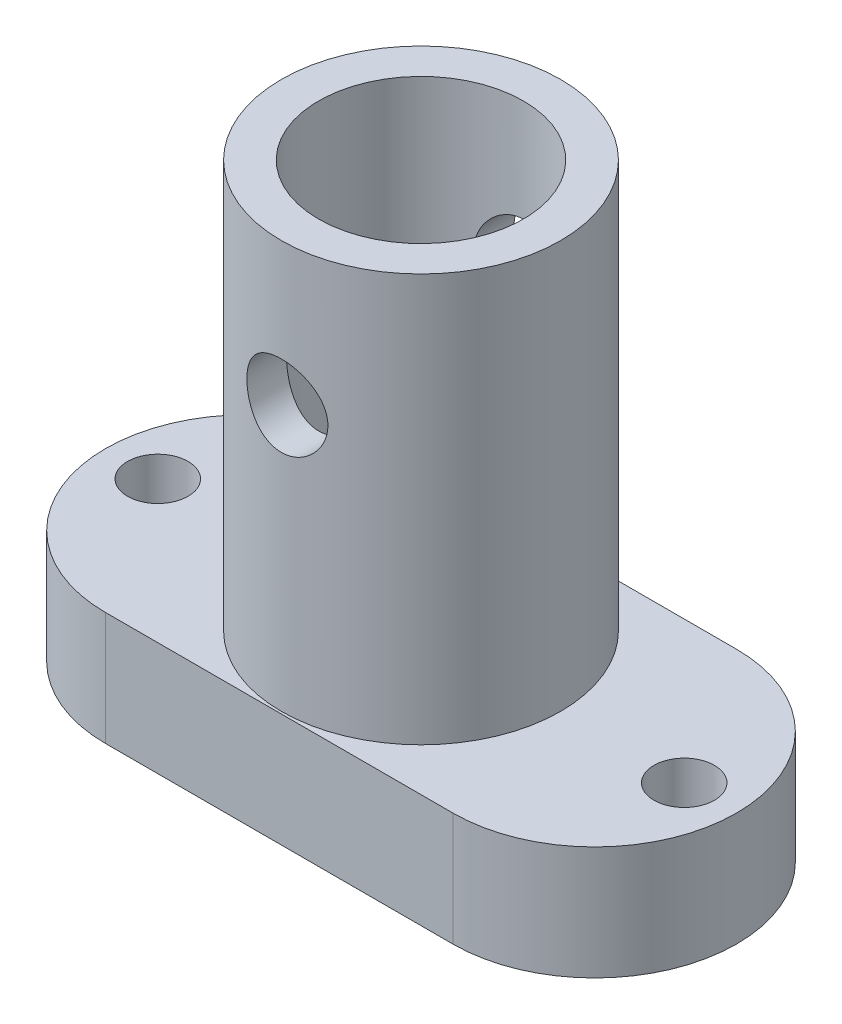
ISO-10303-21;
HEADER;
FILE_DESCRIPTION(('STEP AP214'),'2;1');
FILE_NAME('part.step','',(''),(''),'','','');
FILE_SCHEMA(('AUTOMOTIVE_DESIGN { 1 0 10303 214 1 1 1 1 }'));
ENDSEC;
DATA;
#1=APPLICATION_CONTEXT('core data for automotive mechanical design processes');
#2=APPLICATION_PROTOCOL_DEFINITION('international standard','automotive_design',2000,#1);
#3=PRODUCT_CONTEXT('',#1,'mechanical');
#4=PRODUCT('Part','Part','',(#3));
#5=PRODUCT_RELATED_PRODUCT_CATEGORY('part','',(#4));
#6=PRODUCT_DEFINITION_FORMATION('','',#4);
#7=PRODUCT_DEFINITION_CONTEXT('part definition',#1,'design');
#8=PRODUCT_DEFINITION('design','',#6,#7);
#9=PRODUCT_DEFINITION_SHAPE('','',#8);
#10=(LENGTH_UNIT() NAMED_UNIT(*) SI_UNIT(.MILLI.,.METRE.));
#11=(NAMED_UNIT(*) PLANE_ANGLE_UNIT() SI_UNIT($,.RADIAN.));
#12=(NAMED_UNIT(*) SI_UNIT($,.STERADIAN.) SOLID_ANGLE_UNIT());
#13=UNCERTAINTY_MEASURE_WITH_UNIT(LENGTH_MEASURE(1.E-05),#10,'distance_accuracy_value','');
#14=(GEOMETRIC_REPRESENTATION_CONTEXT(3) GLOBAL_UNCERTAINTY_ASSIGNED_CONTEXT((#13)) GLOBAL_UNIT_ASSIGNED_CONTEXT((#10,
#11,#12)) REPRESENTATION_CONTEXT('',''));
#15=CARTESIAN_POINT('',(0.,0.,0.));
#16=DIRECTION('',(0.,0.,1.));
#17=DIRECTION('',(1.,0.,0.));
#18=AXIS2_PLACEMENT_3D('',#15,#16,#17);
#19=CARTESIAN_POINT('',(0.,4.572,5.715));
#20=DIRECTION('',(0.,0.,-1.));
#21=DIRECTION('',(-1.,0.,0.));
#22=AXIS2_PLACEMENT_3D('',#19,#20,#21);
#23=PLANE('',#22);
#24=DIRECTION('',(1.,0.,0.));
#25=VECTOR('',#24,1.);
#26=CARTESIAN_POINT('',(0.,0.,5.715));
#27=LINE('',#26,#25);
#28=CARTESIAN_POINT('',(3.6045,0.,5.715));
#29=VERTEX_POINT('',#28);
#30=CARTESIAN_POINT('',(17.6045,0.,5.715));
#31=VERTEX_POINT('',#30);
#32=EDGE_CURVE('E117',#29,#31,#27,.T.);
#33=ORIENTED_EDGE('',*,*,#32,.T.);
#34=DIRECTION('',(0.,-1.,0.));
#35=VECTOR('',#34,1.);
#36=CARTESIAN_POINT('',(17.6045,4.572,5.715));
#37=LINE('',#36,#35);
#38=CARTESIAN_POINT('',(17.6045,4.572,5.715));
#39=VERTEX_POINT('',#38);
#40=EDGE_CURVE('E52',#39,#31,#37,.T.);
#41=ORIENTED_EDGE('',*,*,#40,.F.);
#42=DIRECTION('',(1.,0.,0.));
#43=VECTOR('',#42,1.);
#44=CARTESIAN_POINT('',(0.,4.572,5.715));
#45=LINE('',#44,#43);
#46=CARTESIAN_POINT('',(3.6045,4.572,5.715));
#47=VERTEX_POINT('',#46);
#48=EDGE_CURVE('E93',#47,#39,#45,.T.);
#49=ORIENTED_EDGE('',*,*,#48,.F.);
#50=DIRECTION('',(0.,-1.,0.));
#51=VECTOR('',#50,1.);
#52=CARTESIAN_POINT('',(3.6045,4.572,5.715));
#53=LINE('',#52,#51);
#54=EDGE_CURVE('E106',#47,#29,#53,.T.);
#55=ORIENTED_EDGE('',*,*,#54,.T.);
#56=EDGE_LOOP('',(#33,#41,#49,#55));
#57=FACE_BOUND('',#56,.T.);
#58=ADVANCED_FACE('F37',(#57),#23,.F.);
#59=CARTESIAN_POINT('',(17.6045,4.572,0.));
#60=DIRECTION('',(0.,-1.,0.));
#61=DIRECTION('',(0.,0.,-1.));
#62=AXIS2_PLACEMENT_3D('',#59,#60,#61);
#63=CYLINDRICAL_SURFACE('',#62,5.715);
#64=CARTESIAN_POINT('',(17.6045,0.,0.));
#65=DIRECTION('',(0.,1.,0.));
#66=DIRECTION('',(0.,0.,1.));
#67=AXIS2_PLACEMENT_3D('',#64,#65,#66);
#68=CIRCLE('',#67,5.715);
#69=CARTESIAN_POINT('',(17.6045,0.,-5.71500000000001));
#70=VERTEX_POINT('',#69);
#71=EDGE_CURVE('E99',#31,#70,#68,.T.);
#72=ORIENTED_EDGE('',*,*,#71,.T.);
#73=DIRECTION('',(0.,-1.,0.));
#74=VECTOR('',#73,1.);
#75=CARTESIAN_POINT('',(17.6045,4.572,-5.71500000000001));
#76=LINE('',#75,#74);
#77=CARTESIAN_POINT('',(17.6045,4.572,-5.71500000000001));
#78=VERTEX_POINT('',#77);
#79=EDGE_CURVE('E97',#78,#70,#76,.T.);
#80=ORIENTED_EDGE('',*,*,#79,.F.);
#81=CARTESIAN_POINT('',(17.6045,4.572,0.));
#82=DIRECTION('',(0.,1.,0.));
#83=DIRECTION('',(0.,0.,1.));
#84=AXIS2_PLACEMENT_3D('',#81,#82,#83);
#85=CIRCLE('',#84,5.715);
#86=EDGE_CURVE('E88',#39,#78,#85,.T.);
#87=ORIENTED_EDGE('',*,*,#86,.F.);
#88=ORIENTED_EDGE('',*,*,#40,.T.);
#89=EDGE_LOOP('',(#72,#80,#87,#88));
#90=FACE_BOUND('',#89,.T.);
#91=ADVANCED_FACE('F98',(#90),#63,.T.);
#92=CARTESIAN_POINT('',(0.,4.572,-5.715));
#93=DIRECTION('',(0.,0.,-1.));
#94=DIRECTION('',(-1.,0.,0.));
#95=AXIS2_PLACEMENT_3D('',#92,#93,#94);
#96=PLANE('',#95);
#97=DIRECTION('',(1.,0.,0.));
#98=VECTOR('',#97,1.);
#99=CARTESIAN_POINT('',(0.,0.,-5.715));
#100=LINE('',#99,#98);
#101=CARTESIAN_POINT('',(3.6045,0.,-5.715));
#102=VERTEX_POINT('',#101);
#103=EDGE_CURVE('E121',#102,#70,#100,.T.);
#104=ORIENTED_EDGE('',*,*,#103,.F.);
#105=DIRECTION('',(0.,-1.,0.));
#106=VECTOR('',#105,1.);
#107=CARTESIAN_POINT('',(3.6045,4.572,-5.715));
#108=LINE('',#107,#106);
#109=CARTESIAN_POINT('',(3.6045,4.572,-5.715));
#110=VERTEX_POINT('',#109);
#111=EDGE_CURVE('E77',#110,#102,#108,.T.);
#112=ORIENTED_EDGE('',*,*,#111,.F.);
#113=DIRECTION('',(1.,0.,0.));
#114=VECTOR('',#113,1.);
#115=CARTESIAN_POINT('',(0.,4.572,-5.715));
#116=LINE('',#115,#114);
#117=EDGE_CURVE('E91',#110,#78,#116,.T.);
#118=ORIENTED_EDGE('',*,*,#117,.T.);
#119=ORIENTED_EDGE('',*,*,#79,.T.);
#120=EDGE_LOOP('',(#104,#112,#118,#119));
#121=FACE_BOUND('',#120,.T.);
#122=ADVANCED_FACE('F104',(#121),#96,.T.);
#123=CARTESIAN_POINT('',(0.,4.572,0.));
#124=DIRECTION('',(0.,-1.,0.));
#125=DIRECTION('',(0.,0.,-1.));
#126=AXIS2_PLACEMENT_3D('',#123,#124,#125);
#127=CYLINDRICAL_SURFACE('',#126,1.2192);
#128=CARTESIAN_POINT('',(0.,4.572,0.));
#129=DIRECTION('',(0.,1.,0.));
#130=DIRECTION('',(0.,0.,1.));
#131=AXIS2_PLACEMENT_3D('',#128,#129,#130);
#132=CIRCLE('',#131,1.2192);
#133=CARTESIAN_POINT('',(0.,4.572,1.2192));
#134=VERTEX_POINT('',#133);
#135=EDGE_CURVE('E190',#134,#134,#132,.T.);
#136=ORIENTED_EDGE('',*,*,#135,.T.);
#137=EDGE_LOOP('',(#136));
#138=FACE_BOUND('',#137,.T.);
#139=CARTESIAN_POINT('',(0.,0.,0.));
#140=DIRECTION('',(0.,1.,0.));
#141=DIRECTION('',(0.,0.,1.));
#142=AXIS2_PLACEMENT_3D('',#139,#140,#141);
#143=CIRCLE('',#142,1.2192);
#144=CARTESIAN_POINT('',(0.,0.,1.2192));
#145=VERTEX_POINT('',#144);
#146=EDGE_CURVE('E113',#145,#145,#143,.T.);
#147=ORIENTED_EDGE('',*,*,#146,.F.);
#148=EDGE_LOOP('',(#147));
#149=FACE_BOUND('',#148,.T.);
#150=ADVANCED_FACE('F176',(#138,#149),#127,.F.);
#151=CARTESIAN_POINT('',(21.209,4.572,0.));
#152=DIRECTION('',(0.,-1.,0.));
#153=DIRECTION('',(0.,0.,-1.));
#154=AXIS2_PLACEMENT_3D('',#151,#152,#153);
#155=CYLINDRICAL_SURFACE('',#154,1.2192);
#156=CARTESIAN_POINT('',(21.209,4.572,0.));
#157=DIRECTION('',(0.,1.,0.));
#158=DIRECTION('',(0.,0.,1.));
#159=AXIS2_PLACEMENT_3D('',#156,#157,#158);
#160=CIRCLE('',#159,1.2192);
#161=CARTESIAN_POINT('',(21.209,4.572,1.2192));
#162=VERTEX_POINT('',#161);
#163=EDGE_CURVE('E124',#162,#162,#160,.T.);
#164=ORIENTED_EDGE('',*,*,#163,.T.);
#165=EDGE_LOOP('',(#164));
#166=FACE_BOUND('',#165,.T.);
#167=CARTESIAN_POINT('',(21.209,0.,0.));
#168=DIRECTION('',(0.,1.,0.));
#169=DIRECTION('',(0.,0.,1.));
#170=AXIS2_PLACEMENT_3D('',#167,#168,#169);
#171=CIRCLE('',#170,1.2192);
#172=CARTESIAN_POINT('',(21.209,0.,1.2192));
#173=VERTEX_POINT('',#172);
#174=EDGE_CURVE('E110',#173,#173,#171,.T.);
#175=ORIENTED_EDGE('',*,*,#174,.F.);
#176=EDGE_LOOP('',(#175));
#177=FACE_BOUND('',#176,.T.);
#178=ADVANCED_FACE('F39',(#166,#177),#155,.F.);
#179=CARTESIAN_POINT('',(3.6045,4.572,0.));
#180=DIRECTION('',(0.,-1.,0.));
#181=DIRECTION('',(0.,0.,-1.));
#182=AXIS2_PLACEMENT_3D('',#179,#180,#181);
#183=CYLINDRICAL_SURFACE('',#182,5.715);
#184=CARTESIAN_POINT('',(3.6045,0.,0.));
#185=DIRECTION('',(0.,1.,0.));
#186=DIRECTION('',(0.,0.,1.));
#187=AXIS2_PLACEMENT_3D('',#184,#185,#186);
#188=CIRCLE('',#187,5.715);
#189=EDGE_CURVE('E80',#102,#29,#188,.T.);
#190=ORIENTED_EDGE('',*,*,#189,.T.);
#191=ORIENTED_EDGE('',*,*,#54,.F.);
#192=CARTESIAN_POINT('',(3.6045,4.572,0.));
#193=DIRECTION('',(0.,1.,0.));
#194=DIRECTION('',(0.,0.,1.));
#195=AXIS2_PLACEMENT_3D('',#192,#193,#194);
#196=CIRCLE('',#195,5.715);
#197=EDGE_CURVE('E61',#110,#47,#196,.T.);
#198=ORIENTED_EDGE('',*,*,#197,.F.);
#199=ORIENTED_EDGE('',*,*,#111,.T.);
#200=EDGE_LOOP('',(#190,#191,#198,#199));
#201=FACE_BOUND('',#200,.T.);
#202=ADVANCED_FACE('F166',(#201),#183,.T.);
#203=CARTESIAN_POINT('',(0.,4.572,0.));
#204=DIRECTION('',(0.,1.,0.));
#205=DIRECTION('',(0.,0.,1.));
#206=AXIS2_PLACEMENT_3D('',#203,#204,#205);
#207=PLANE('',#206);
#208=CARTESIAN_POINT('',(10.6045,4.572,0.));
#209=DIRECTION('',(0.,1.,0.));
#210=DIRECTION('',(0.,0.,1.));
#211=AXIS2_PLACEMENT_3D('',#208,#209,#210);
#212=CIRCLE('',#211,5.625);
#213=CARTESIAN_POINT('',(10.6045,4.572,5.625));
#214=VERTEX_POINT('',#213);
#215=EDGE_CURVE('E114',#214,#214,#212,.F.);
#216=ORIENTED_EDGE('',*,*,#215,.T.);
#217=EDGE_LOOP('',(#216));
#218=FACE_BOUND('',#217,.T.);
#219=ORIENTED_EDGE('',*,*,#163,.F.);
#220=EDGE_LOOP('',(#219));
#221=FACE_BOUND('',#220,.T.);
#222=ORIENTED_EDGE('',*,*,#135,.F.);
#223=EDGE_LOOP('',(#222));
#224=FACE_BOUND('',#223,.T.);
#225=ORIENTED_EDGE('',*,*,#48,.T.);
#226=ORIENTED_EDGE('',*,*,#86,.T.);
#227=ORIENTED_EDGE('',*,*,#117,.F.);
#228=ORIENTED_EDGE('',*,*,#197,.T.);
#229=EDGE_LOOP('',(#225,#226,#227,#228));
#230=FACE_BOUND('',#229,.T.);
#231=ADVANCED_FACE('F89',(#218,#221,#224,#230),#207,.T.);
#232=CARTESIAN_POINT('',(0.,0.,0.));
#233=DIRECTION('',(0.,1.,0.));
#234=DIRECTION('',(0.,0.,1.));
#235=AXIS2_PLACEMENT_3D('',#232,#233,#234);
#236=PLANE('',#235);
#237=ORIENTED_EDGE('',*,*,#174,.T.);
#238=EDGE_LOOP('',(#237));
#239=FACE_BOUND('',#238,.T.);
#240=ORIENTED_EDGE('',*,*,#146,.T.);
#241=EDGE_LOOP('',(#240));
#242=FACE_BOUND('',#241,.T.);
#243=ORIENTED_EDGE('',*,*,#32,.F.);
#244=ORIENTED_EDGE('',*,*,#189,.F.);
#245=ORIENTED_EDGE('',*,*,#103,.T.);
#246=ORIENTED_EDGE('',*,*,#71,.F.);
#247=EDGE_LOOP('',(#243,#244,#245,#246));
#248=FACE_BOUND('',#247,.T.);
#249=ADVANCED_FACE('F161',(#239,#242,#248),#236,.F.);
#250=CARTESIAN_POINT('',(10.6045,21.,0.));
#251=DIRECTION('',(0.,-1.,0.));
#252=DIRECTION('',(0.,0.,-1.));
#253=AXIS2_PLACEMENT_3D('',#250,#251,#252);
#254=CYLINDRICAL_SURFACE('',#253,4.125);
#255=CARTESIAN_POINT('',(10.6045,16.87195,-4.125));
#256=CARTESIAN_POINT('',(10.5166883793754,16.871940946148,-4.12499340767717));
#257=CARTESIAN_POINT('',(10.428747128912,16.8648223356702,-4.12216380836748));
#258=CARTESIAN_POINT('',(10.2553448156189,16.8365927104448,-4.11112057501812));
#259=CARTESIAN_POINT('',(10.1698906248595,16.8154461769253,-4.10289327455494));
#260=CARTESIAN_POINT('',(10.0042405352548,16.7600489037697,-4.08194310530132));
#261=CARTESIAN_POINT('',(9.92402890649818,16.7258396920679,-4.06923449287898));
#262=CARTESIAN_POINT('',(9.77054931124609,16.6454523844735,-4.04057602648775));
#263=CARTESIAN_POINT('',(9.69727927351862,16.5992778742442,-4.02462714384537));
#264=CARTESIAN_POINT('',(9.55627612716227,16.4940136839175,-3.99028056465838));
#265=CARTESIAN_POINT('',(9.48890650126679,16.4344617195674,-3.97180799254277));
#266=CARTESIAN_POINT('',(9.36480532956372,16.3051092252215,-3.93484222407253));
#267=CARTESIAN_POINT('',(9.30807872764035,16.235303959085,-3.91634902212751));
#268=CARTESIAN_POINT('',(9.20445417772263,16.083751016355,-3.88054594584938));
#269=CARTESIAN_POINT('',(9.15808859289572,16.0016169401129,-3.86332206286507));
#270=CARTESIAN_POINT('',(9.07999239627785,15.8299315977681,-3.83317975444899));
#271=CARTESIAN_POINT('',(9.04825503387884,15.7403837755001,-3.82025934382293));
#272=CARTESIAN_POINT('',(9.00177901461743,15.5605884892861,-3.80098955600758));
#273=CARTESIAN_POINT('',(8.98634529532728,15.4705503854881,-3.79437279204214));
#274=CARTESIAN_POINT('',(8.97074303852796,15.2889379575986,-3.78768303130777));
#275=CARTESIAN_POINT('',(8.97056720892753,15.1973643882715,-3.78760690861833));
#276=CARTESIAN_POINT('',(8.98495811318366,15.0219006455919,-3.79377848066294));
#277=CARTESIAN_POINT('',(8.99852587280007,14.9379105631917,-3.79959766896938));
#278=CARTESIAN_POINT('',(9.03835569349941,14.7735142267283,-3.81618624736696));
#279=CARTESIAN_POINT('',(9.06461991728417,14.6931085857844,-3.82695648079838));
#280=CARTESIAN_POINT('',(9.12959312315189,14.5362492568144,-3.85246796144322));
#281=CARTESIAN_POINT('',(9.16854234411599,14.4599079361343,-3.86728489538495));
#282=CARTESIAN_POINT('',(9.25761149251849,14.3145685532578,-3.89919868651602));
#283=CARTESIAN_POINT('',(9.30773555741056,14.2455732249101,-3.91629638720845));
#284=CARTESIAN_POINT('',(9.42217961209273,14.1114047816617,-3.95241738289371));
#285=CARTESIAN_POINT('',(9.48728550366198,14.046913167492,-3.97148861598903));
#286=CARTESIAN_POINT('',(9.62759472459153,13.9295482184764,-4.00830852302938));
#287=CARTESIAN_POINT('',(9.70279997424053,13.8766770982007,-4.02605694445498));
#288=CARTESIAN_POINT('',(9.86307108997108,13.7831857884388,-4.05865883774419));
#289=CARTESIAN_POINT('',(9.94829678839911,13.7428166996947,-4.07345108695915));
#290=CARTESIAN_POINT('',(10.1250628112977,13.6772218460005,-4.09801272936968));
#291=CARTESIAN_POINT('',(10.216599975081,13.6519885618004,-4.10778461626216));
#292=CARTESIAN_POINT('',(10.3976739014479,13.6187476325524,-4.12075291683032));
#293=CARTESIAN_POINT('',(10.4870175618331,13.6098238067999,-4.12429858828712));
#294=CARTESIAN_POINT('',(10.6659871717959,13.6067565538352,-4.12551138126503));
#295=CARTESIAN_POINT('',(10.7556130444611,13.6126093979346,-4.12317998578297));
#296=CARTESIAN_POINT('',(10.9284850222541,13.6382514358937,-4.11312961030443));
#297=CARTESIAN_POINT('',(11.0118386987373,13.6574197715034,-4.10565077643937));
#298=CARTESIAN_POINT('',(11.17407309975,13.7083087970367,-4.08630523784855));
#299=CARTESIAN_POINT('',(11.252953246431,13.7400311043611,-4.07443796774809));
#300=CARTESIAN_POINT('',(11.4066990473141,13.8161601019641,-4.04702210295983));
#301=CARTESIAN_POINT('',(11.4813696153009,13.8609232613544,-4.03137251363023));
#302=CARTESIAN_POINT('',(11.622399929118,13.9614666114197,-3.99809498928989));
#303=CARTESIAN_POINT('',(11.6887563682805,14.0172511629004,-3.98046627239876));
#304=CARTESIAN_POINT('',(11.815769696391,14.14248286124,-3.94374204868224));
#305=CARTESIAN_POINT('',(11.8757814345074,14.2125798337329,-3.92462535717454));
#306=CARTESIAN_POINT('',(11.9833430590168,14.3621948832883,-3.88814240932567));
#307=CARTESIAN_POINT('',(12.0308910781765,14.4417143693824,-3.87077641550221));
#308=CARTESIAN_POINT('',(12.1124268669897,14.6090124070738,-3.8397539491899));
#309=CARTESIAN_POINT('',(12.1462943775421,14.6968561649438,-3.82613069762627));
#310=CARTESIAN_POINT('',(12.1985011980614,14.8776995586725,-3.80468092929429));
#311=CARTESIAN_POINT('',(12.2168516221766,14.9706954533444,-3.79685026407699));
#312=CARTESIAN_POINT('',(12.2364528033675,15.1521266618302,-3.78846382086177));
#313=CARTESIAN_POINT('',(12.2388196316767,15.2404202504586,-3.78743333917695));
#314=CARTESIAN_POINT('',(12.2293044981445,15.4160822057724,-3.7915250263539));
#315=CARTESIAN_POINT('',(12.2174242509568,15.5034506825197,-3.79664645482549));
#316=CARTESIAN_POINT('',(12.1806564082298,15.6714005177124,-3.81205027894463));
#317=CARTESIAN_POINT('',(12.1562779733595,15.7521136001888,-3.82213006967219));
#318=CARTESIAN_POINT('',(12.09567713453,15.9083386113476,-3.84617640641352));
#319=CARTESIAN_POINT('',(12.0594515976197,15.9838491578242,-3.86014398040101));
#320=CARTESIAN_POINT('',(11.9738214045852,16.1321665503677,-3.8913711982291));
#321=CARTESIAN_POINT('',(11.9237884552171,16.2045804365511,-3.90877212659018));
#322=CARTESIAN_POINT('',(11.8128880112117,16.3403396331284,-3.94446616587733));
#323=CARTESIAN_POINT('',(11.7520166681798,16.4036817079272,-3.96275959202259));
#324=CARTESIAN_POINT('',(11.6166060765998,16.5235826807772,-3.99956086979757));
#325=CARTESIAN_POINT('',(11.541447472667,16.5794631398754,-4.01800966693103));
#326=CARTESIAN_POINT('',(11.3821367427446,16.6778096548081,-4.05185408435435));
#327=CARTESIAN_POINT('',(11.2979834722345,16.7202740007919,-4.06724931538173));
#328=CARTESIAN_POINT('',(11.1304934207119,16.7872634131552,-4.09212758364161));
#329=CARTESIAN_POINT('',(11.0477030850852,16.8130127069835,-4.10200382967647));
#330=CARTESIAN_POINT('',(10.8788021578872,16.8510459639742,-4.1167361266833));
#331=CARTESIAN_POINT('',(10.7927013331119,16.8633667973196,-4.12160592164162));
#332=CARTESIAN_POINT('',(10.6723613311223,16.8708948848859,-4.12458336014981));
#333=CARTESIAN_POINT('',(10.6384403484198,16.8719534994331,-4.12500254801964));
#334=CARTESIAN_POINT('',(10.6045,16.87195,-4.125));
#335=B_SPLINE_CURVE_WITH_KNOTS('',3,(#255,#256,#257,#258,#259,#260,#261,#262,#263,#264,#265,
#266,#267,#268,#269,#270,#271,#272,#273,#274,#275,#276,#277,#278,#279,#280,#281,#282,#283,#284,
#285,#286,#287,#288,#289,#290,#291,#292,#293,#294,#295,#296,#297,#298,#299,#300,#301,#302,#303,
#304,#305,#306,#307,#308,#309,#310,#311,#312,#313,#314,#315,#316,#317,#318,#319,#320,#321,#322,
#323,#324,#325,#326,#327,#328,#329,#330,#331,#332,#333,#334),.UNSPECIFIED.,.T.,.F.,(4,2,2,2,2,2,
2,2,2,2,2,2,2,2,2,2,2,2,2,2,2,2,2,2,2,2,2,2,2,2,2,2,2,2,2,2,2,2,2,4),(0.,0.263333596578846,
0.527336513177587,0.790507025665702,1.05359876437638,1.32777820208675,1.6020846876559,
1.88827657608846,2.17433626059928,2.44763665641147,2.72080643505152,2.97545090973418,
3.23013877557074,3.48996175289799,3.74988108916405,4.02941763587357,4.30900740902705,
4.59389461307872,4.87864017180108,5.14683108009083,5.41495432087692,5.67134827888513,
5.927775280369,6.19200196282713,6.4563334013017,6.73774146279088,7.01919165894311,
7.30306475995543,7.58673436357551,7.85037103020131,8.11397597099893,8.3676070165802,
8.62130518887943,8.88931815789555,9.15742648089119,9.4424200732445,9.72744997269177,
9.98808727859019,10.2480071422827,10.3497890471713),.UNSPECIFIED.);
#336=CARTESIAN_POINT('',(10.6045,16.87195,-4.125));
#337=VERTEX_POINT('',#336);
#338=EDGE_CURVE('E152',#337,#337,#335,.T.);
#339=ORIENTED_EDGE('',*,*,#338,.F.);
#340=EDGE_LOOP('',(#339));
#341=FACE_BOUND('',#340,.T.);
#342=CARTESIAN_POINT('',(12.23645,15.24,3.78845142472489));
#343=CARTESIAN_POINT('',(12.2364405900716,15.1524890438747,3.78846001812333));
#344=CARTESIAN_POINT('',(12.2293691658116,15.0648493909532,3.79152635745544));
#345=CARTESIAN_POINT('',(12.2013445497676,14.8920788058211,3.80341015670328));
#346=CARTESIAN_POINT('',(12.1803554190672,14.8069549660638,3.81224250494568));
#347=CARTESIAN_POINT('',(12.1254173926444,14.6420060008585,3.83448870611017));
#348=CARTESIAN_POINT('',(12.0915166572702,14.5621624633271,3.84788551423038));
#349=CARTESIAN_POINT('',(12.0118580582143,14.4093156729136,3.87772740752946));
#350=CARTESIAN_POINT('',(11.9661029750756,14.3363108214169,3.89417177761832));
#351=CARTESIAN_POINT('',(11.8612961796456,14.1950876720769,3.92928607021321));
#352=CARTESIAN_POINT('',(11.8016878874708,14.1272997864574,3.9480265616037));
#353=CARTESIAN_POINT('',(11.6720389012323,14.0023692188633,3.98503795156309));
#354=CARTESIAN_POINT('',(11.601994617484,13.9452302150839,4.00330868600326));
#355=CARTESIAN_POINT('',(11.4501521506755,13.841098525582,4.03816617035294));
#356=CARTESIAN_POINT('',(11.3680056666368,13.794580251183,4.05466119971969));
#357=CARTESIAN_POINT('',(11.1962842158915,13.7162056184859,4.08325556985035));
#358=CARTESIAN_POINT('',(11.1067122266665,13.6843434166322,4.09535666212476));
#359=CARTESIAN_POINT('',(10.9271934251779,13.6377151297686,4.11330035108716));
#360=CARTESIAN_POINT('',(10.8374662816434,13.6222092360848,4.11941278967412));
#361=CARTESIAN_POINT('',(10.6564893059313,13.606353615789,4.12566454903571));
#362=CARTESIAN_POINT('',(10.5652400409925,13.6059983639759,4.12580604731831));
#363=CARTESIAN_POINT('',(10.3891486947764,13.6200439678598,4.12026553293643));
#364=CARTESIAN_POINT('',(10.3042301328874,13.6336347769834,4.11490320195081));
#365=CARTESIAN_POINT('',(10.1379929703373,13.6738116141851,4.09938637121227));
#366=CARTESIAN_POINT('',(10.0566746338219,13.7003985940644,4.08923152047126));
#367=CARTESIAN_POINT('',(9.89848979369813,13.7661413873726,4.06493293469415));
#368=CARTESIAN_POINT('',(9.8217083675615,13.8054797569607,4.05073164944278));
#369=CARTESIAN_POINT('',(9.67563952297492,13.8954394111617,4.01975452316294));
#370=CARTESIAN_POINT('',(9.60635466050744,13.9460645261413,4.00297780871815));
#371=CARTESIAN_POINT('',(9.47251017563486,14.0609620557341,3.9672821067936));
#372=CARTESIAN_POINT('',(9.40854211798788,14.1259033488863,3.94829473588316));
#373=CARTESIAN_POINT('',(9.29216557864331,14.2656730990954,3.91115624544002));
#374=CARTESIAN_POINT('',(9.23976071517326,14.3405046392206,3.89300538906184));
#375=CARTESIAN_POINT('',(9.14668602636825,14.5005194108539,3.85913594708571));
#376=CARTESIAN_POINT('',(9.10637289347916,14.5859282966045,3.84349664985046));
#377=CARTESIAN_POINT('',(9.04093485975836,14.7631058275271,3.81734799016614));
#378=CARTESIAN_POINT('',(9.01580034897956,14.8548704076431,3.80683538270093));
#379=CARTESIAN_POINT('',(8.98285531660382,15.036262078193,3.79291396561603));
#380=CARTESIAN_POINT('',(8.97409479461075,15.1256864166223,3.78911634669581));
#381=CARTESIAN_POINT('',(8.97138096302995,15.3047885112541,3.78794835657574));
#382=CARTESIAN_POINT('',(8.97742331404507,15.3944661854944,3.7905761018082));
#383=CARTESIAN_POINT('',(9.00327932903745,15.5663277288503,3.80156444885905));
#384=CARTESIAN_POINT('',(9.02231439282673,15.6486520024769,3.80960058496506));
#385=CARTESIAN_POINT('',(9.07261091088559,15.8088867423186,3.83010090081969));
#386=CARTESIAN_POINT('',(9.10387503921548,15.8867962389108,3.84256604898063));
#387=CARTESIAN_POINT('',(9.17914202066747,16.0394673491902,3.87113123472147));
#388=CARTESIAN_POINT('',(9.22360486542794,16.113977965839,3.88735684350238));
#389=CARTESIAN_POINT('',(9.32353355209244,16.2548142753065,3.92141981566735));
#390=CARTESIAN_POINT('',(9.37900379759292,16.3211366750836,3.93925782254372));
#391=CARTESIAN_POINT('',(9.50408705871288,16.4486728967384,3.97608588774995));
#392=CARTESIAN_POINT('',(9.574430547793,16.5091756765664,3.99506647863986));
#393=CARTESIAN_POINT('',(9.72472793966363,16.6176240149322,4.03082944620774));
#394=CARTESIAN_POINT('',(9.80468216190933,16.6655691558928,4.04761174977714));
#395=CARTESIAN_POINT('',(9.97214788974642,16.7473359677784,4.07712758516514));
#396=CARTESIAN_POINT('',(10.059652646813,16.7811700962409,4.08986468580531));
#397=CARTESIAN_POINT('',(10.2397382757299,16.8334199164758,4.10983722023446));
#398=CARTESIAN_POINT('',(10.3323164318315,16.8518437729791,4.11707556720799));
#399=CARTESIAN_POINT('',(10.5135295281855,16.8717958731187,4.12492989985925));
#400=CARTESIAN_POINT('',(10.6020374721461,16.8743302695959,4.12594018504515));
#401=CARTESIAN_POINT('',(10.7781722717137,16.8650761847225,4.1222830918064));
#402=CARTESIAN_POINT('',(10.8657992538343,16.853289790465,4.11761654071624));
#403=CARTESIAN_POINT('',(11.03503497011,16.8164460959334,4.10332447907159));
#404=CARTESIAN_POINT('',(11.1167450211233,16.7917911386145,4.09384954155123));
#405=CARTESIAN_POINT('',(11.2748579068068,16.7303287680241,4.07094992431886));
#406=CARTESIAN_POINT('',(11.3512597492557,16.6935190901247,4.05752450861748));
#407=CARTESIAN_POINT('',(11.5002692059301,16.6069694560279,4.02731374475839));
#408=CARTESIAN_POINT('',(11.5725633029683,16.5567330701635,4.01040682979209));
#409=CARTESIAN_POINT('',(11.7079958225618,16.4455052222265,3.97527678505231));
#410=CARTESIAN_POINT('',(11.7711305557009,16.3845094480435,3.95705312929533));
#411=CARTESIAN_POINT('',(11.8903849488695,16.2491475940506,3.91998193423548));
#412=CARTESIAN_POINT('',(11.9458525070916,16.1741972645254,3.90116298698125));
#413=CARTESIAN_POINT('',(12.0434643341555,16.0154464030845,3.86622642447516));
#414=CARTESIAN_POINT('',(12.0856069158082,15.931644752218,3.85010915142663));
#415=CARTESIAN_POINT('',(12.1520232395696,15.7651174067128,3.82386699267353));
#416=CARTESIAN_POINT('',(12.1775488599073,15.6829535821552,3.81333784716478));
#417=CARTESIAN_POINT('',(12.2153431137703,15.5152910175774,3.79753147273323));
#418=CARTESIAN_POINT('',(12.227648951319,15.4298023418812,3.79223950830307));
#419=CARTESIAN_POINT('',(12.2353487432695,15.3093284164206,3.78892467117385));
#420=CARTESIAN_POINT('',(12.2364537284792,15.2746743107032,3.78844801977789));
#421=CARTESIAN_POINT('',(12.23645,15.24,3.78845142472489));
#422=B_SPLINE_CURVE_WITH_KNOTS('',3,(#342,#343,#344,#345,#346,#347,#348,#349,#350,#351,#352,
#353,#354,#355,#356,#357,#358,#359,#360,#361,#362,#363,#364,#365,#366,#367,#368,#369,#370,#371,
#372,#373,#374,#375,#376,#377,#378,#379,#380,#381,#382,#383,#384,#385,#386,#387,#388,#389,#390,
#391,#392,#393,#394,#395,#396,#397,#398,#399,#400,#401,#402,#403,#404,#405,#406,#407,#408,#409,
#410,#411,#412,#413,#414,#415,#416,#417,#418,#419,#420,#421),.UNSPECIFIED.,.T.,.F.,(4,2,2,2,2,2,
2,2,2,2,2,2,2,2,2,2,2,2,2,2,2,2,2,2,2,2,2,2,2,2,2,2,2,2,2,2,2,2,2,4),(0.,0.262426881018636,
0.525534065088971,0.787669319863168,1.0497431440532,1.32510573892533,1.60056327031564,
1.88660856212837,2.17253970510971,2.44489659288454,2.71715415552926,2.97444614898967,
3.23175698857865,3.49292761593511,3.75418701167617,4.0322697903374,4.31043946059321,
4.59615108343844,4.88168162528683,5.15005947202991,5.41835865440152,5.67184749097939,
5.9253917875402,6.18908937999558,6.45289268018395,6.73567918258208,7.01847508724037,
7.30102080175517,7.5834167217893,7.84773351915533,8.11201179996079,8.36848262964621,
8.62500127112441,8.89277395166837,9.1606541940642,9.44467899518308,9.72873974471903,
9.98764591053369,10.245821520457,10.3498024573844),.UNSPECIFIED.);
#423=CARTESIAN_POINT('',(12.23645,15.24,3.78845142472489));
#424=VERTEX_POINT('',#423);
#425=EDGE_CURVE('E147',#424,#424,#422,.T.);
#426=ORIENTED_EDGE('',*,*,#425,.F.);
#427=EDGE_LOOP('',(#426));
#428=FACE_BOUND('',#427,.T.);
#429=CARTESIAN_POINT('',(10.6045,4.572,0.));
#430=DIRECTION('',(0.,1.,0.));
#431=DIRECTION('',(0.,0.,1.));
#432=AXIS2_PLACEMENT_3D('',#429,#430,#431);
#433=CIRCLE('',#432,4.125);
#434=CARTESIAN_POINT('',(10.6045,4.572,4.125));
#435=VERTEX_POINT('',#434);
#436=EDGE_CURVE('E11',#435,#435,#433,.F.);
#437=ORIENTED_EDGE('',*,*,#436,.T.);
#438=EDGE_LOOP('',(#437));
#439=FACE_BOUND('',#438,.T.);
#440=CARTESIAN_POINT('',(10.6045,21.,0.));
#441=DIRECTION('',(0.,1.,0.));
#442=DIRECTION('',(0.,0.,1.));
#443=AXIS2_PLACEMENT_3D('',#440,#441,#442);
#444=CIRCLE('',#443,4.125);
#445=CARTESIAN_POINT('',(10.6045,21.,4.125));
#446=VERTEX_POINT('',#445);
#447=EDGE_CURVE('E203',#446,#446,#444,.T.);
#448=ORIENTED_EDGE('',*,*,#447,.T.);
#449=EDGE_LOOP('',(#448));
#450=FACE_BOUND('',#449,.T.);
#451=ADVANCED_FACE('F157',(#341,#428,#439,#450),#254,.F.);
#452=CARTESIAN_POINT('',(10.6045,21.,0.));
#453=DIRECTION('',(0.,-1.,0.));
#454=DIRECTION('',(0.,0.,-1.));
#455=AXIS2_PLACEMENT_3D('',#452,#453,#454);
#456=CYLINDRICAL_SURFACE('',#455,5.625);
#457=CARTESIAN_POINT('',(10.6045,16.87195,-5.625));
#458=CARTESIAN_POINT('',(10.5148382981579,16.8719485627876,-5.6249990172692));
#459=CARTESIAN_POINT('',(10.4251619264494,16.864536189582,-5.62283552443476));
#460=CARTESIAN_POINT('',(10.2484120756342,16.8351473685765,-5.61441587477669));
#461=CARTESIAN_POINT('',(10.1613395291817,16.8131657660645,-5.60815826943279));
#462=CARTESIAN_POINT('',(9.99237276332227,16.7554279393195,-5.59223760986098));
#463=CARTESIAN_POINT('',(9.91047138667426,16.719691262104,-5.58257938982023));
#464=CARTESIAN_POINT('',(9.75382346120005,16.6355355470094,-5.56086648636538));
#465=CARTESIAN_POINT('',(9.67907772517657,16.5871150707175,-5.54881153118568));
#466=CARTESIAN_POINT('',(9.5368425317183,16.4775862642145,-5.52323147967207));
#467=CARTESIAN_POINT('',(9.46957389201683,16.4161978755298,-5.5096777485462));
#468=CARTESIAN_POINT('',(9.34612735738249,16.2830732437623,-5.48280245811031));
#469=CARTESIAN_POINT('',(9.28995118561597,16.2113353959271,-5.46948093516541));
#470=CARTESIAN_POINT('',(9.18914877750628,16.0577125236052,-5.44427860436288));
#471=CARTESIAN_POINT('',(9.14478727343955,15.9756473767495,-5.4324335540347));
#472=CARTESIAN_POINT('',(9.07058285280681,15.8048230731915,-5.41195117670335));
#473=CARTESIAN_POINT('',(9.04073670344454,15.7160654121077,-5.40331313555062));
#474=CARTESIAN_POINT('',(8.99719747330193,15.5368452244564,-5.39052036504331));
#475=CARTESIAN_POINT('',(8.98309930387536,15.4464893255316,-5.38625344879363));
#476=CARTESIAN_POINT('',(8.97019184871788,15.2646018094628,-5.38235184154484));
#477=CARTESIAN_POINT('',(8.97137912608978,15.1730704612396,-5.38271610923455));
#478=CARTESIAN_POINT('',(8.9886896404027,14.994682659388,-5.38793597882283));
#479=CARTESIAN_POINT('',(9.0043108564781,14.9077723502964,-5.39264061184008));
#480=CARTESIAN_POINT('',(9.04923689114041,14.7378630451449,-5.40576765510438));
#481=CARTESIAN_POINT('',(9.07854298121149,14.6548644133145,-5.41419041080434));
#482=CARTESIAN_POINT('',(9.15038852489659,14.4938819222807,-5.4339288641992));
#483=CARTESIAN_POINT('',(9.1930948031411,14.4159771344874,-5.4452806917268));
#484=CARTESIAN_POINT('',(9.29041239252752,14.2682689332482,-5.46958023144916));
#485=CARTESIAN_POINT('',(9.34502642615359,14.1984673780558,-5.4825283083016));
#486=CARTESIAN_POINT('',(9.46712519775547,14.066092994682,-5.5091786974331));
#487=CARTESIAN_POINT('',(9.53502812950568,14.0039072320055,-5.52289075143551));
#488=CARTESIAN_POINT('',(9.68046889490611,13.8917187439152,-5.54907591606401));
#489=CARTESIAN_POINT('',(9.75800725890997,13.8417166895662,-5.56154895842433));
#490=CARTESIAN_POINT('',(9.92118914586691,13.7551002721874,-5.5839524249839));
#491=CARTESIAN_POINT('',(10.0068779175863,13.7185668849115,-5.5938673658624));
#492=CARTESIAN_POINT('',(10.183536847235,13.6605417381683,-5.60992592600996));
#493=CARTESIAN_POINT('',(10.2745056243126,13.6390460649919,-5.61607052649497));
#494=CARTESIAN_POINT('',(10.4558478849127,13.6123395958218,-5.62374295635295));
#495=CARTESIAN_POINT('',(10.5461378621445,13.6066037281246,-5.62541958624113));
#496=CARTESIAN_POINT('',(10.7263937448683,13.6101146497305,-5.62440102280101));
#497=CARTESIAN_POINT('',(10.8163596891773,13.6193595802618,-5.62170637184782));
#498=CARTESIAN_POINT('',(10.9914650482594,13.652143024395,-5.61234507926803));
#499=CARTESIAN_POINT('',(11.0766660214506,13.6753790117116,-5.60576256032621));
#500=CARTESIAN_POINT('',(11.2419452096298,13.7351249178412,-5.589382053228));
#501=CARTESIAN_POINT('',(11.3220228232478,13.7716363915554,-5.57958368842636));
#502=CARTESIAN_POINT('',(11.4767476611279,13.8578063289292,-5.55752244279364));
#503=CARTESIAN_POINT('',(11.5512356448381,13.9077376605036,-5.54520985500428));
#504=CARTESIAN_POINT('',(11.6909561875054,14.0189949847957,-5.51953736206741));
#505=CARTESIAN_POINT('',(11.7561865689236,14.0803236505438,-5.50617721165959));
#506=CARTESIAN_POINT('',(11.8778226327592,14.2150980053823,-5.47935122774732));
#507=CARTESIAN_POINT('',(11.9338554910815,14.2888832020872,-5.46589708697986));
#508=CARTESIAN_POINT('',(12.032764692578,14.4451001505737,-5.44089120859697));
#509=CARTESIAN_POINT('',(12.0756414631475,14.5275316213514,-5.42933940918677));
#510=CARTESIAN_POINT('',(12.1467135982189,14.6983811628001,-5.40958079618989));
#511=CARTESIAN_POINT('',(12.1749842572435,14.7867658210268,-5.40135687598307));
#512=CARTESIAN_POINT('',(12.216168026161,14.9673209204612,-5.38921339808098));
#513=CARTESIAN_POINT('',(12.2290859717143,15.0594901601676,-5.38529248509277));
#514=CARTESIAN_POINT('',(12.2388837380524,15.2411429521595,-5.38232640978451));
#515=CARTESIAN_POINT('',(12.2363685327437,15.3305913156276,-5.38309731982218));
#516=CARTESIAN_POINT('',(12.2168029568739,15.5077305452925,-5.38898935754156));
#517=CARTESIAN_POINT('',(12.199753099941,15.5954214734819,-5.39411033149986));
#518=CARTESIAN_POINT('',(12.1519811103552,15.7656379743015,-5.40800621729044));
#519=CARTESIAN_POINT('',(12.1214093184471,15.8482092653819,-5.4167408838846));
#520=CARTESIAN_POINT('',(12.047577720879,16.0071161282137,-5.43687495282239));
#521=CARTESIAN_POINT('',(12.004315612321,16.0834505649526,-5.44827483874419));
#522=CARTESIAN_POINT('',(11.9045912104525,16.2305492529931,-5.4729433005702));
#523=CARTESIAN_POINT('',(11.8477268556845,16.3010324368229,-5.48626258113589));
#524=CARTESIAN_POINT('',(11.7231483360291,16.4316523591304,-5.51301219383599));
#525=CARTESIAN_POINT('',(11.6554314175331,16.4917864636957,-5.52644255333192));
#526=CARTESIAN_POINT('',(11.5088889185938,16.6015966557113,-5.55233110663013));
#527=CARTESIAN_POINT('',(11.4298148345137,16.6509503219474,-5.56475372929792));
#528=CARTESIAN_POINT('',(11.2641309981563,16.7355904214746,-5.58681279287876));
#529=CARTESIAN_POINT('',(11.1775252148251,16.770884209766,-5.59645068981015));
#530=CARTESIAN_POINT('',(11.0103616819019,16.8227883871534,-5.61088628029436));
#531=CARTESIAN_POINT('',(10.9303910567486,16.8411763239237,-5.61613682606782));
#532=CARTESIAN_POINT('',(10.7684508503144,16.8657569131753,-5.62319388831104));
#533=CARTESIAN_POINT('',(10.6864815573322,16.8719513141052,-5.62500089855312));
#534=CARTESIAN_POINT('',(10.6045,16.87195,-5.625));
#535=B_SPLINE_CURVE_WITH_KNOTS('',3,(#457,#458,#459,#460,#461,#462,#463,#464,#465,#466,#467,
#468,#469,#470,#471,#472,#473,#474,#475,#476,#477,#478,#479,#480,#481,#482,#483,#484,#485,#486,
#487,#488,#489,#490,#491,#492,#493,#494,#495,#496,#497,#498,#499,#500,#501,#502,#503,#504,#505,
#506,#507,#508,#509,#510,#511,#512,#513,#514,#515,#516,#517,#518,#519,#520,#521,#522,#523,#524,
#525,#526,#527,#528,#529,#530,#531,#532,#533,#534),.UNSPECIFIED.,.T.,.F.,(4,2,2,2,2,2,2,2,2,2,2,
2,2,2,2,2,2,2,2,2,2,2,2,2,2,2,2,2,2,2,2,2,2,2,2,2,2,2,4),(0.,0.268684121123529,
0.537463355659352,0.805862036118282,1.07429116765617,1.34925184081249,1.62425519436003,
1.90498237134899,2.18564699734568,2.45891268117137,2.7321169229165,2.9961627491837,
3.26023311326607,3.52773096402553,3.79529003738512,4.07326230700361,4.3512498835594,
4.63088251480257,4.91044234187678,5.18056811759116,5.45066037949115,5.71511227379865,
5.97959515221409,6.24992658823705,6.52032150560813,6.7998563324721,7.07938207726618,
7.35745211643428,7.63543454835571,7.90259165804606,8.16973932727937,8.43398864593085,
8.69828594731597,8.97165362021519,9.24509076451628,9.52583514426965,9.80643246761672,
10.0521371711231,10.2978066401115),.UNSPECIFIED.);
#536=CARTESIAN_POINT('',(10.6045,16.87195,-5.625));
#537=VERTEX_POINT('',#536);
#538=EDGE_CURVE('E41',#537,#537,#535,.T.);
#539=ORIENTED_EDGE('',*,*,#538,.T.);
#540=EDGE_LOOP('',(#539));
#541=FACE_BOUND('',#540,.T.);
#542=CARTESIAN_POINT('',(12.23645,15.24,5.3830627153601));
#543=CARTESIAN_POINT('',(12.2364485309732,15.1504279218634,5.38306387848712));
#544=CARTESIAN_POINT('',(12.2290504486376,15.0608411242656,5.38532284363841));
#545=CARTESIAN_POINT('',(12.1997235303753,14.8842768900155,5.39408138473065));
#546=CARTESIAN_POINT('',(12.1777891085468,14.7973004698923,5.40058259082936));
#547=CARTESIAN_POINT('',(12.1201891046904,14.628537861675,5.41702868079416));
#548=CARTESIAN_POINT('',(12.0845452611503,14.546743694239,5.42696811030714));
#549=CARTESIAN_POINT('',(12.0006087086694,14.3902781617617,5.44916347869876));
#550=CARTESIAN_POINT('',(11.9523143769868,14.3156077121931,5.46141971470967));
#551=CARTESIAN_POINT('',(11.8429179340039,14.1732993115245,5.48727446409797));
#552=CARTESIAN_POINT('',(11.7815073274429,14.1059033910876,5.50090014314226));
#553=CARTESIAN_POINT('',(11.648283406075,13.9822078723236,5.52772572398106));
#554=CARTESIAN_POINT('',(11.5764688395938,13.9259096110545,5.54092557431123));
#555=CARTESIAN_POINT('',(11.42276714238,13.8249694159639,5.56571914635693));
#556=CARTESIAN_POINT('',(11.3407129175429,13.7805723673441,5.57727711395742));
#557=CARTESIAN_POINT('',(11.1699115529232,13.7062993444325,5.59717024350844));
#558=CARTESIAN_POINT('',(11.0811657628151,13.6764204508622,5.60550605329435));
#559=CARTESIAN_POINT('',(10.9020308448253,13.6328274100731,5.61782347512763));
#560=CARTESIAN_POINT('',(10.8117499149086,13.6187005628511,5.62191604611451));
#561=CARTESIAN_POINT('',(10.6300128328107,13.6057096726579,5.62567576306215));
#562=CARTESIAN_POINT('',(10.5385569155574,13.6068426246561,5.62534378032673));
#563=CARTESIAN_POINT('',(10.3599542122275,13.6240579569999,5.62037111401935));
#564=CARTESIAN_POINT('',(10.2727602371955,13.6396937509629,5.61585914971288));
#565=CARTESIAN_POINT('',(10.1022916348211,13.6847439013623,5.60318851580961));
#566=CARTESIAN_POINT('',(10.0190172494484,13.7141591072244,5.59502962140089));
#567=CARTESIAN_POINT('',(9.85766611816765,13.7862475313596,5.57579995152683));
#568=CARTESIAN_POINT('',(9.7796577342678,13.8290650185384,5.56469770146747));
#569=CARTESIAN_POINT('',(9.63178746719321,13.9266295731109,5.54076477206291));
#570=CARTESIAN_POINT('',(9.56192742030107,13.9813793215765,5.52793370451572));
#571=CARTESIAN_POINT('',(9.42967093337355,14.1035876375791,5.50137434617982));
#572=CARTESIAN_POINT('',(9.36763555812044,14.1714340532512,5.4876303886032));
#573=CARTESIAN_POINT('',(9.25572523062565,14.3167042348563,5.46120379005343));
#574=CARTESIAN_POINT('',(9.20585132985355,14.3941288280379,5.44852124091087));
#575=CARTESIAN_POINT('',(9.11933534210316,14.5572559649665,5.42558198583652));
#576=CARTESIAN_POINT('',(9.0828087094548,14.6430229708668,5.41534669967439));
#577=CARTESIAN_POINT('',(9.02481967780544,14.8198549453507,5.39871794517061));
#578=CARTESIAN_POINT('',(9.00335273591412,14.9109183072572,5.39232331834355));
#579=CARTESIAN_POINT('',(8.97675103488846,15.0923396727912,5.38435192441507));
#580=CARTESIAN_POINT('',(8.971070553418,15.1826106610545,5.38261424984118));
#581=CARTESIAN_POINT('',(8.97468527818645,15.3628164586493,5.38370998349237));
#582=CARTESIAN_POINT('',(8.98397854808046,15.4527513099413,5.38654280068002));
#583=CARTESIAN_POINT('',(9.01679237975544,15.6275101628008,5.39630314890126));
#584=CARTESIAN_POINT('',(9.03996880013384,15.712404875014,5.40313154391912));
#585=CARTESIAN_POINT('',(9.09949576239483,15.8770974498956,5.42001274071478));
#586=CARTESIAN_POINT('',(9.13584824656804,15.9568945590826,5.43006601784906));
#587=CARTESIAN_POINT('',(9.22175264848791,16.1113659037911,5.45258182203024));
#588=CARTESIAN_POINT('',(9.27161625108154,16.1858586395434,5.46509903671378));
#589=CARTESIAN_POINT('',(9.38275240508911,16.3256191251913,5.49101152749694));
#590=CARTESIAN_POINT('',(9.44402750780686,16.3908848064149,5.50440699951644));
#591=CARTESIAN_POINT('',(9.57880036592696,16.5126878056599,5.53113360215216));
#592=CARTESIAN_POINT('',(9.65265059290692,16.5688401148787,5.54444610408992));
#593=CARTESIAN_POINT('',(9.80903838890052,16.6679600984012,5.56903238862035));
#594=CARTESIAN_POINT('',(9.89157550890169,16.7109284537147,5.58030627650413));
#595=CARTESIAN_POINT('',(10.0624291559041,16.7820485572211,5.59947401061893));
#596=CARTESIAN_POINT('',(10.1506960904279,16.8103122418772,5.60739330448545));
#597=CARTESIAN_POINT('',(10.3309957127844,16.851521506082,5.61907198045672));
#598=CARTESIAN_POINT('',(10.4230273923441,16.8644711596001,5.62283246890513));
#599=CARTESIAN_POINT('',(10.6046746835388,16.8743914147233,5.62570707472312));
#600=CARTESIAN_POINT('',(10.6942575200419,16.8719221923243,5.62498408596828));
#601=CARTESIAN_POINT('',(10.8716783308337,16.8524020837681,5.61935212381324));
#602=CARTESIAN_POINT('',(10.9595163930233,16.8353519341078,5.61444336184062));
#603=CARTESIAN_POINT('',(11.1301507527482,16.7874921988372,5.6010337074283));
#604=CARTESIAN_POINT('',(11.2129869202903,16.7568144520453,5.59256727475023));
#605=CARTESIAN_POINT('',(11.3723814535224,16.6826877545095,5.57292018004954));
#606=CARTESIAN_POINT('',(11.4489388255386,16.6392367872616,5.56173908951333));
#607=CARTESIAN_POINT('',(11.5961335224782,16.5392606956814,5.53742050262632));
#608=CARTESIAN_POINT('',(11.6665196959196,16.4823778478283,5.52423381268382));
#609=CARTESIAN_POINT('',(11.7969357593084,16.357807274552,5.49755962602663));
#610=CARTESIAN_POINT('',(11.8569627419807,16.2901165261528,5.48407204606351));
#611=CARTESIAN_POINT('',(11.9665975470228,16.1436295453414,5.45789200033476));
#612=CARTESIAN_POINT('',(12.0158757899415,16.0645803667614,5.44523133795137));
#613=CARTESIAN_POINT('',(12.1003809480971,15.8989631879287,5.42262761742159));
#614=CARTESIAN_POINT('',(12.1356153957102,15.8123992486345,5.41268310337493));
#615=CARTESIAN_POINT('',(12.1874075102694,15.6453734726142,5.3977458692175));
#616=CARTESIAN_POINT('',(12.2057501856623,15.5655029304427,5.39228932076282));
#617=CARTESIAN_POINT('',(12.2302710681285,15.4037587974551,5.38494751570665));
#618=CARTESIAN_POINT('',(12.2364513429639,15.3218855495211,5.38306165204554));
#619=CARTESIAN_POINT('',(12.23645,15.24,5.3830627153601));
#620=B_SPLINE_CURVE_WITH_KNOTS('',3,(#542,#543,#544,#545,#546,#547,#548,#549,#550,#551,#552,
#553,#554,#555,#556,#557,#558,#559,#560,#561,#562,#563,#564,#565,#566,#567,#568,#569,#570,#571,
#572,#573,#574,#575,#576,#577,#578,#579,#580,#581,#582,#583,#584,#585,#586,#587,#588,#589,#590,
#591,#592,#593,#594,#595,#596,#597,#598,#599,#600,#601,#602,#603,#604,#605,#606,#607,#608,#609,
#610,#611,#612,#613,#614,#615,#616,#617,#618,#619),.UNSPECIFIED.,.T.,.F.,(4,2,2,2,2,2,2,2,2,2,2,
2,2,2,2,2,2,2,2,2,2,2,2,2,2,2,2,2,2,2,2,2,2,2,2,2,2,2,4),(0.,0.268414476494424,
0.536932156890856,0.805025803157497,1.07315385600395,1.34846600083942,1.62381129533364,
1.90444979300311,2.18503183712782,2.45807607290454,2.73106654032721,2.9959203046053,
3.26079039782214,3.52861587422152,3.79650159075443,4.07407053495131,4.35166346899418,
4.63160372755179,4.91145950327401,5.18151291110483,5.45153139952503,5.71511851913335,
5.97874451007354,6.24906363830962,6.51944327532738,6.79927736578955,7.07909699914458,
7.35675418876822,7.63433749702665,7.90189620366716,8.16944139645065,8.43445278641329,
8.69950603612488,8.97262769908324,9.24582588858414,9.5264903435518,9.80700406118286,
10.0524265753973,10.2978073610664),.UNSPECIFIED.);
#621=CARTESIAN_POINT('',(12.23645,15.24,5.3830627153601));
#622=VERTEX_POINT('',#621);
#623=EDGE_CURVE('E127',#622,#622,#620,.T.);
#624=ORIENTED_EDGE('',*,*,#623,.T.);
#625=EDGE_LOOP('',(#624));
#626=FACE_BOUND('',#625,.T.);
#627=ORIENTED_EDGE('',*,*,#215,.F.);
#628=EDGE_LOOP('',(#627));
#629=FACE_BOUND('',#628,.T.);
#630=CARTESIAN_POINT('',(10.6045,21.,0.));
#631=DIRECTION('',(0.,1.,0.));
#632=DIRECTION('',(0.,0.,1.));
#633=AXIS2_PLACEMENT_3D('',#630,#631,#632);
#634=CIRCLE('',#633,5.625);
#635=CARTESIAN_POINT('',(10.6045,21.,5.625));
#636=VERTEX_POINT('',#635);
#637=EDGE_CURVE('E201',#636,#636,#634,.T.);
#638=ORIENTED_EDGE('',*,*,#637,.F.);
#639=EDGE_LOOP('',(#638));
#640=FACE_BOUND('',#639,.T.);
#641=ADVANCED_FACE('F132',(#541,#626,#629,#640),#456,.T.);
#642=CARTESIAN_POINT('',(0.,21.,0.));
#643=DIRECTION('',(0.,1.,0.));
#644=DIRECTION('',(0.,0.,1.));
#645=AXIS2_PLACEMENT_3D('',#642,#643,#644);
#646=PLANE('',#645);
#647=ORIENTED_EDGE('',*,*,#447,.F.);
#648=EDGE_LOOP('',(#647));
#649=FACE_BOUND('',#648,.T.);
#650=ORIENTED_EDGE('',*,*,#637,.T.);
#651=EDGE_LOOP('',(#650));
#652=FACE_BOUND('',#651,.T.);
#653=ADVANCED_FACE('F141',(#649,#652),#646,.T.);
#654=ORIENTED_EDGE('',*,*,#436,.F.);
#655=EDGE_LOOP('',(#654));
#656=FACE_BOUND('',#655,.T.);
#657=ADVANCED_FACE('F168',(#656),#207,.T.);
#658=CARTESIAN_POINT('',(10.6045,15.24,-18.923));
#659=DIRECTION('',(0.,0.,1.));
#660=DIRECTION('',(1.,0.,0.));
#661=AXIS2_PLACEMENT_3D('',#658,#659,#660);
#662=CYLINDRICAL_SURFACE('',#661,1.63195);
#663=ORIENTED_EDGE('',*,*,#425,.T.);
#664=EDGE_LOOP('',(#663));
#665=FACE_BOUND('',#664,.T.);
#666=ORIENTED_EDGE('',*,*,#623,.F.);
#667=EDGE_LOOP('',(#666));
#668=FACE_BOUND('',#667,.T.);
#669=ADVANCED_FACE('F139',(#665,#668),#662,.F.);
#670=ORIENTED_EDGE('',*,*,#338,.T.);
#671=EDGE_LOOP('',(#670));
#672=FACE_BOUND('',#671,.T.);
#673=ORIENTED_EDGE('',*,*,#538,.F.);
#674=EDGE_LOOP('',(#673));
#675=FACE_BOUND('',#674,.T.);
#676=ADVANCED_FACE('F136',(#672,#675),#662,.F.);
#677=CLOSED_SHELL('',(#58,#91,#122,#150,#178,#202,#231,#249,#451,#641,#653,#657,#669,#676));
#678=MANIFOLD_SOLID_BREP('B2',#677);
#679=ADVANCED_BREP_SHAPE_REPRESENTATION('',(#18,#678),#14);
#680=SHAPE_DEFINITION_REPRESENTATION(#9,#679);
ENDSEC;
END-ISO-10303-21;
